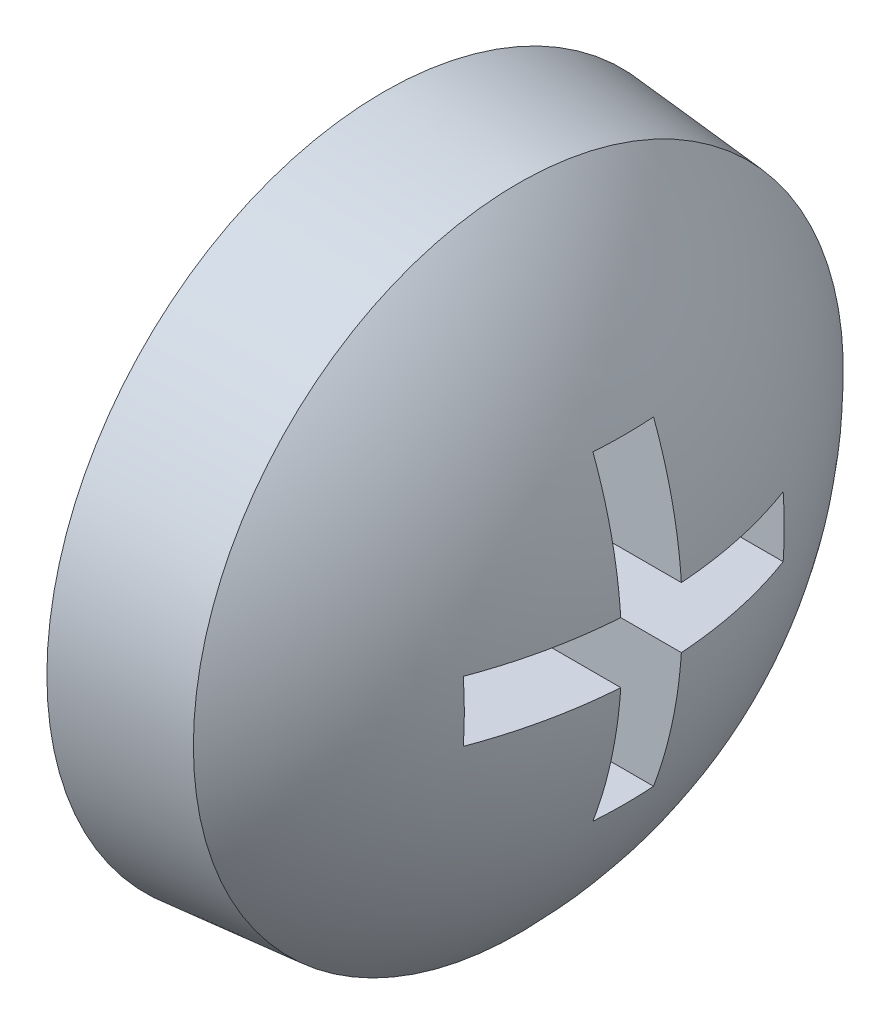
ISO-10303-21;
HEADER;
FILE_DESCRIPTION(('STEP AP214'),'2;1');
FILE_NAME('part.step','',(''),(''),'','','');
FILE_SCHEMA(('AUTOMOTIVE_DESIGN { 1 0 10303 214 1 1 1 1 }'));
ENDSEC;
DATA;
#1=APPLICATION_CONTEXT('core data for automotive mechanical design processes');
#2=APPLICATION_PROTOCOL_DEFINITION('international standard','automotive_design',2000,#1);
#3=PRODUCT_CONTEXT('',#1,'mechanical');
#4=PRODUCT('Part','Part','',(#3));
#5=PRODUCT_RELATED_PRODUCT_CATEGORY('part','',(#4));
#6=PRODUCT_DEFINITION_FORMATION('','',#4);
#7=PRODUCT_DEFINITION_CONTEXT('part definition',#1,'design');
#8=PRODUCT_DEFINITION('design','',#6,#7);
#9=PRODUCT_DEFINITION_SHAPE('','',#8);
#10=(LENGTH_UNIT() NAMED_UNIT(*) SI_UNIT(.MILLI.,.METRE.));
#11=(NAMED_UNIT(*) PLANE_ANGLE_UNIT() SI_UNIT($,.RADIAN.));
#12=(NAMED_UNIT(*) SI_UNIT($,.STERADIAN.) SOLID_ANGLE_UNIT());
#13=UNCERTAINTY_MEASURE_WITH_UNIT(LENGTH_MEASURE(1.E-05),#10,'distance_accuracy_value','');
#14=(GEOMETRIC_REPRESENTATION_CONTEXT(3) GLOBAL_UNCERTAINTY_ASSIGNED_CONTEXT((#13)) GLOBAL_UNIT_ASSIGNED_CONTEXT((#10,
#11,#12)) REPRESENTATION_CONTEXT('',''));
#15=CARTESIAN_POINT('',(0.,0.,0.));
#16=DIRECTION('',(0.,0.,1.));
#17=DIRECTION('',(1.,0.,0.));
#18=AXIS2_PLACEMENT_3D('',#15,#16,#17);
#19=CARTESIAN_POINT('',(104.166666666667,6.9,10.));
#20=DIRECTION('',(1.,0.,0.));
#21=DIRECTION('',(0.,0.,-1.));
#22=AXIS2_PLACEMENT_3D('',#19,#20,#21);
#23=PLANE('',#22);
#24=DIRECTION('',(0.,0.,1.));
#25=VECTOR('',#24,1.);
#26=CARTESIAN_POINT('',(104.166666666667,5.95,10.));
#27=LINE('',#26,#25);
#28=CARTESIAN_POINT('',(104.166666666667,5.95,9.82));
#29=VERTEX_POINT('',#28);
#30=CARTESIAN_POINT('',(104.166666666667,5.95,10.18));
#31=VERTEX_POINT('',#30);
#32=EDGE_CURVE('E293',#29,#31,#27,.T.);
#33=ORIENTED_EDGE('',*,*,#32,.F.);
#34=DIRECTION('',(0.,1.,0.));
#35=VECTOR('',#34,1.);
#36=CARTESIAN_POINT('',(104.166666666667,6.9,9.82));
#37=LINE('',#36,#35);
#38=CARTESIAN_POINT('',(104.166666666667,6.72,9.82));
#39=VERTEX_POINT('',#38);
#40=EDGE_CURVE('E298',#39,#29,#37,.F.);
#41=ORIENTED_EDGE('',*,*,#40,.F.);
#42=DIRECTION('',(0.,0.,1.));
#43=VECTOR('',#42,1.);
#44=CARTESIAN_POINT('',(104.166666666667,6.72,10.));
#45=LINE('',#44,#43);
#46=CARTESIAN_POINT('',(104.166666666667,6.72,9.05));
#47=VERTEX_POINT('',#46);
#48=EDGE_CURVE('E303',#47,#39,#45,.T.);
#49=ORIENTED_EDGE('',*,*,#48,.F.);
#50=DIRECTION('',(0.,1.,0.));
#51=VECTOR('',#50,1.);
#52=CARTESIAN_POINT('',(104.166666666667,6.9,9.05));
#53=LINE('',#52,#51);
#54=CARTESIAN_POINT('',(104.166666666667,7.08,9.05));
#55=VERTEX_POINT('',#54);
#56=EDGE_CURVE('E308',#55,#47,#53,.F.);
#57=ORIENTED_EDGE('',*,*,#56,.F.);
#58=DIRECTION('',(0.,0.,-1.));
#59=VECTOR('',#58,1.);
#60=CARTESIAN_POINT('',(104.166666666667,7.08,10.));
#61=LINE('',#60,#59);
#62=CARTESIAN_POINT('',(104.166666666667,7.08,9.82));
#63=VERTEX_POINT('',#62);
#64=EDGE_CURVE('E313',#63,#55,#61,.T.);
#65=ORIENTED_EDGE('',*,*,#64,.F.);
#66=DIRECTION('',(0.,1.,0.));
#67=VECTOR('',#66,1.);
#68=CARTESIAN_POINT('',(104.166666666667,6.9,9.82));
#69=LINE('',#68,#67);
#70=CARTESIAN_POINT('',(104.166666666667,7.85,9.82));
#71=VERTEX_POINT('',#70);
#72=EDGE_CURVE('E318',#71,#63,#69,.F.);
#73=ORIENTED_EDGE('',*,*,#72,.F.);
#74=DIRECTION('',(0.,0.,1.));
#75=VECTOR('',#74,1.);
#76=CARTESIAN_POINT('',(104.166666666667,7.85,10.));
#77=LINE('',#76,#75);
#78=CARTESIAN_POINT('',(104.166666666667,7.85,10.18));
#79=VERTEX_POINT('',#78);
#80=EDGE_CURVE('E267',#71,#79,#77,.T.);
#81=ORIENTED_EDGE('',*,*,#80,.T.);
#82=DIRECTION('',(0.,1.,0.));
#83=VECTOR('',#82,1.);
#84=CARTESIAN_POINT('',(104.166666666667,6.9,10.18));
#85=LINE('',#84,#83);
#86=CARTESIAN_POINT('',(104.166666666667,7.08,10.18));
#87=VERTEX_POINT('',#86);
#88=EDGE_CURVE('E264',#87,#79,#85,.T.);
#89=ORIENTED_EDGE('',*,*,#88,.F.);
#90=DIRECTION('',(0.,0.,-1.));
#91=VECTOR('',#90,1.);
#92=CARTESIAN_POINT('',(104.166666666667,7.08,10.));
#93=LINE('',#92,#91);
#94=CARTESIAN_POINT('',(104.166666666667,7.08,10.95));
#95=VERTEX_POINT('',#94);
#96=EDGE_CURVE('E260',#95,#87,#93,.T.);
#97=ORIENTED_EDGE('',*,*,#96,.F.);
#98=DIRECTION('',(0.,1.,0.));
#99=VECTOR('',#98,1.);
#100=CARTESIAN_POINT('',(104.166666666667,6.9,10.95));
#101=LINE('',#100,#99);
#102=CARTESIAN_POINT('',(104.166666666667,6.72,10.95));
#103=VERTEX_POINT('',#102);
#104=EDGE_CURVE('E231',#95,#103,#101,.F.);
#105=ORIENTED_EDGE('',*,*,#104,.T.);
#106=DIRECTION('',(0.,0.,1.));
#107=VECTOR('',#106,1.);
#108=CARTESIAN_POINT('',(104.166666666667,6.72,10.));
#109=LINE('',#108,#107);
#110=CARTESIAN_POINT('',(104.166666666667,6.72,10.18));
#111=VERTEX_POINT('',#110);
#112=EDGE_CURVE('E278',#111,#103,#109,.T.);
#113=ORIENTED_EDGE('',*,*,#112,.F.);
#114=DIRECTION('',(0.,1.,0.));
#115=VECTOR('',#114,1.);
#116=CARTESIAN_POINT('',(104.166666666667,6.9,10.18));
#117=LINE('',#116,#115);
#118=EDGE_CURVE('E288',#31,#111,#117,.T.);
#119=ORIENTED_EDGE('',*,*,#118,.F.);
#120=EDGE_LOOP('',(#33,#41,#49,#57,#65,#73,#81,#89,#97,#105,#113,#119));
#121=FACE_BOUND('',#120,.T.);
#122=ADVANCED_FACE('F17',(#121),#23,.T.);
#123=CARTESIAN_POINT('',(104.766666666667,7.08,10.));
#124=DIRECTION('',(0.,-1.,0.));
#125=DIRECTION('',(0.,0.,-1.));
#126=AXIS2_PLACEMENT_3D('',#123,#124,#125);
#127=PLANE('',#126);
#128=DIRECTION('',(1.,0.,0.));
#129=VECTOR('',#128,1.);
#130=CARTESIAN_POINT('',(104.766666666667,7.08,10.95));
#131=LINE('',#130,#129);
#132=CARTESIAN_POINT('',(105.189571189858,7.08,10.9499999999999));
#133=VERTEX_POINT('',#132);
#134=EDGE_CURVE('E89',#133,#95,#131,.F.);
#135=ORIENTED_EDGE('',*,*,#134,.T.);
#136=ORIENTED_EDGE('',*,*,#96,.T.);
#137=DIRECTION('',(-1.,0.,0.));
#138=VECTOR('',#137,1.);
#139=CARTESIAN_POINT('',(104.766666666667,7.08,10.18));
#140=LINE('',#139,#138);
#141=CARTESIAN_POINT('',(105.354764236461,7.07999999999998,10.18));
#142=VERTEX_POINT('',#141);
#143=EDGE_CURVE('E224',#142,#87,#140,.T.);
#144=ORIENTED_EDGE('',*,*,#143,.F.);
#145=CARTESIAN_POINT('',(105.189571189858,7.08,10.9499999999998));
#146=CARTESIAN_POINT('',(105.201116204051,7.08,10.9189995540504));
#147=CARTESIAN_POINT('',(105.212095586435,7.08,10.8877884938066));
#148=CARTESIAN_POINT('',(105.232868784973,7.08,10.8251104536467));
#149=CARTESIAN_POINT('',(105.242667091984,7.08,10.7936449620739));
#150=CARTESIAN_POINT('',(105.261090632624,7.08,10.7304618501355));
#151=CARTESIAN_POINT('',(105.269718872253,7.08,10.6987451062671));
#152=CARTESIAN_POINT('',(105.28581062142,7.08,10.6350619663154));
#153=CARTESIAN_POINT('',(105.293275650242,7.08,10.6030959541241));
#154=CARTESIAN_POINT('',(105.307044828628,7.08,10.5389148788567));
#155=CARTESIAN_POINT('',(105.313348978193,7.08,10.5066998157807));
#156=CARTESIAN_POINT('',(105.324795725558,7.08,10.4420201537523));
#157=CARTESIAN_POINT('',(105.329936780304,7.08,10.4095552817085));
#158=CARTESIAN_POINT('',(105.339051828977,7.08,10.3443751591892));
#159=CARTESIAN_POINT('',(105.343022721906,7.08,10.3116594750372));
#160=CARTESIAN_POINT('',(105.349787708815,7.08,10.2459761632456));
#161=CARTESIAN_POINT('',(105.352577096634,7.08,10.2130080508537));
#162=CARTESIAN_POINT('',(105.35476423646,7.08,10.18));
#163=B_SPLINE_CURVE_WITH_KNOTS('',3,(#145,#146,#147,#148,#149,#150,#151,#152,#153,#154,#155,
#156,#157,#158,#159,#160,#161,#162),.UNSPECIFIED.,.F.,.F.,(4,2,2,2,2,2,2,2,4),(0.,
0.0992357442434011,0.198081387639235,0.296668072480437,0.395124892694024,0.493581712907605,
0.592168397748812,0.691014041144642,0.790249785388046),.UNSPECIFIED.);
#164=EDGE_CURVE('E20',#133,#142,#163,.T.);
#165=ORIENTED_EDGE('',*,*,#164,.F.);
#166=EDGE_LOOP('',(#135,#136,#144,#165));
#167=FACE_BOUND('',#166,.T.);
#168=ADVANCED_FACE('F221',(#167),#127,.T.);
#169=CARTESIAN_POINT('',(104.766666666667,6.9,10.18));
#170=DIRECTION('',(0.,0.,-1.));
#171=DIRECTION('',(-1.,0.,0.));
#172=AXIS2_PLACEMENT_3D('',#169,#170,#171);
#173=PLANE('',#172);
#174=ORIENTED_EDGE('',*,*,#88,.T.);
#175=DIRECTION('',(1.,0.,0.));
#176=VECTOR('',#175,1.);
#177=CARTESIAN_POINT('',(104.766666666667,7.85,10.18));
#178=LINE('',#177,#176);
#179=CARTESIAN_POINT('',(105.189571189858,7.85,10.18));
#180=VERTEX_POINT('',#179);
#181=EDGE_CURVE('E324',#79,#180,#178,.T.);
#182=ORIENTED_EDGE('',*,*,#181,.T.);
#183=CARTESIAN_POINT('',(105.35476423646,7.07999999999996,10.18));
#184=CARTESIAN_POINT('',(105.349110057772,7.16559008255577,10.18));
#185=CARTESIAN_POINT('',(105.339378570371,7.25090347737763,10.18));
#186=CARTESIAN_POINT('',(105.312011452855,7.4196590615976,10.18));
#187=CARTESIAN_POINT('',(105.294429898816,7.50311001948186,10.18));
#188=CARTESIAN_POINT('',(105.249700769254,7.67504249159032,10.18));
#189=CARTESIAN_POINT('',(105.221864706158,7.7633453110033,10.18));
#190=CARTESIAN_POINT('',(105.189571189858,7.84999999999982,10.18));
#191=B_SPLINE_CURVE_WITH_KNOTS('',3,(#183,#184,#185,#186,#187,#188,#189,#190),.UNSPECIFIED.,.F.,
.F.,(4,2,2,4),(0.,0.257221658829311,0.512698117737293,0.789983486231456),.UNSPECIFIED.);
#192=EDGE_CURVE('E213',#142,#180,#191,.T.);
#193=ORIENTED_EDGE('',*,*,#192,.F.);
#194=ORIENTED_EDGE('',*,*,#143,.T.);
#195=EDGE_LOOP('',(#174,#182,#193,#194));
#196=FACE_BOUND('',#195,.T.);
#197=ADVANCED_FACE('F204',(#196),#173,.T.);
#198=CARTESIAN_POINT('',(104.766666666667,7.85,10.));
#199=DIRECTION('',(0.,1.,0.));
#200=DIRECTION('',(0.,0.,1.));
#201=AXIS2_PLACEMENT_3D('',#198,#199,#200);
#202=PLANE('',#201);
#203=ORIENTED_EDGE('',*,*,#181,.F.);
#204=ORIENTED_EDGE('',*,*,#80,.F.);
#205=DIRECTION('',(1.,0.,0.));
#206=VECTOR('',#205,1.);
#207=CARTESIAN_POINT('',(104.766666666667,7.85,9.82));
#208=LINE('',#207,#206);
#209=CARTESIAN_POINT('',(105.189571189858,7.84999999999991,9.82));
#210=VERTEX_POINT('',#209);
#211=EDGE_CURVE('E320',#210,#71,#208,.F.);
#212=ORIENTED_EDGE('',*,*,#211,.F.);
#213=CARTESIAN_POINT('',(105.189571189857,7.85,10.18));
#214=CARTESIAN_POINT('',(105.193799585556,7.85000000000002,10.12));
#215=CARTESIAN_POINT('',(105.195913783405,7.85000000000002,10.06));
#216=CARTESIAN_POINT('',(105.195913783405,7.84999999999998,9.93999999999997));
#217=CARTESIAN_POINT('',(105.193799585556,7.84999999999994,9.87999999999998));
#218=CARTESIAN_POINT('',(105.189571189857,7.84999999999989,9.81999999999998));
#219=B_SPLINE_CURVE_WITH_KNOTS('',3,(#213,#214,#215,#216,#217,#218),.UNSPECIFIED.,.F.,.F.,(4,2,
4),(0.,0.180111711148678,0.360223422297357),.UNSPECIFIED.);
#220=EDGE_CURVE('E207',#180,#210,#219,.T.);
#221=ORIENTED_EDGE('',*,*,#220,.F.);
#222=EDGE_LOOP('',(#203,#204,#212,#221));
#223=FACE_BOUND('',#222,.T.);
#224=ADVANCED_FACE('F199',(#223),#202,.F.);
#225=CARTESIAN_POINT('',(104.766666666667,6.9,9.82));
#226=DIRECTION('',(0.,0.,1.));
#227=DIRECTION('',(1.,0.,0.));
#228=AXIS2_PLACEMENT_3D('',#225,#226,#227);
#229=PLANE('',#228);
#230=ORIENTED_EDGE('',*,*,#72,.T.);
#231=DIRECTION('',(1.,0.,0.));
#232=VECTOR('',#231,1.);
#233=CARTESIAN_POINT('',(104.766666666667,7.08,9.82));
#234=LINE('',#233,#232);
#235=CARTESIAN_POINT('',(105.354764236461,7.08,9.82000000000002));
#236=VERTEX_POINT('',#235);
#237=EDGE_CURVE('E315',#236,#63,#234,.F.);
#238=ORIENTED_EDGE('',*,*,#237,.F.);
#239=CARTESIAN_POINT('',(105.189571189858,7.84999999999982,9.82));
#240=CARTESIAN_POINT('',(105.201116204051,7.8189995540504,9.82));
#241=CARTESIAN_POINT('',(105.212095586435,7.78778849380655,9.82));
#242=CARTESIAN_POINT('',(105.232868784973,7.72511045364668,9.82));
#243=CARTESIAN_POINT('',(105.242667091984,7.69364496207389,9.82));
#244=CARTESIAN_POINT('',(105.261090632624,7.63046185013545,9.82));
#245=CARTESIAN_POINT('',(105.269718872253,7.5987451062671,9.82));
#246=CARTESIAN_POINT('',(105.28581062142,7.53506196631538,9.82));
#247=CARTESIAN_POINT('',(105.293275650242,7.50309595412407,9.82));
#248=CARTESIAN_POINT('',(105.307044828628,7.43891487885672,9.82));
#249=CARTESIAN_POINT('',(105.313348978193,7.40669981578069,9.82));
#250=CARTESIAN_POINT('',(105.324795725558,7.3420201537523,9.82));
#251=CARTESIAN_POINT('',(105.329936780304,7.30955528170849,9.82));
#252=CARTESIAN_POINT('',(105.339051828977,7.24437515918925,9.82));
#253=CARTESIAN_POINT('',(105.343022721906,7.21165947503717,9.82));
#254=CARTESIAN_POINT('',(105.349787708815,7.14597616324556,9.82));
#255=CARTESIAN_POINT('',(105.352577096634,7.11300805085374,9.82));
#256=CARTESIAN_POINT('',(105.35476423646,7.07999999999997,9.82));
#257=B_SPLINE_CURVE_WITH_KNOTS('',3,(#239,#240,#241,#242,#243,#244,#245,#246,#247,#248,#249,
#250,#251,#252,#253,#254,#255,#256),.UNSPECIFIED.,.F.,.F.,(4,2,2,2,2,2,2,2,4),(0.,
0.0992357442434019,0.198081387639233,0.296668072480435,0.39512489269402,0.493581712907601,
0.592168397748805,0.691014041144637,0.790249785388038),.UNSPECIFIED.);
#258=EDGE_CURVE('E184',#210,#236,#257,.T.);
#259=ORIENTED_EDGE('',*,*,#258,.F.);
#260=ORIENTED_EDGE('',*,*,#211,.T.);
#261=EDGE_LOOP('',(#230,#238,#259,#260));
#262=FACE_BOUND('',#261,.T.);
#263=ADVANCED_FACE('F194',(#262),#229,.T.);
#264=CARTESIAN_POINT('',(104.766666666667,7.08,10.));
#265=DIRECTION('',(0.,-1.,0.));
#266=DIRECTION('',(0.,0.,-1.));
#267=AXIS2_PLACEMENT_3D('',#264,#265,#266);
#268=PLANE('',#267);
#269=DIRECTION('',(1.,0.,0.));
#270=VECTOR('',#269,1.);
#271=CARTESIAN_POINT('',(104.766666666667,7.08,9.05));
#272=LINE('',#271,#270);
#273=CARTESIAN_POINT('',(105.189571189858,7.08,9.05));
#274=VERTEX_POINT('',#273);
#275=EDGE_CURVE('E310',#274,#55,#272,.F.);
#276=ORIENTED_EDGE('',*,*,#275,.F.);
#277=CARTESIAN_POINT('',(105.35476423646,7.08,9.82000000000004));
#278=CARTESIAN_POINT('',(105.349110057772,7.08,9.73440991744423));
#279=CARTESIAN_POINT('',(105.339378570371,7.08,9.64909652262237));
#280=CARTESIAN_POINT('',(105.312011452855,7.08,9.4803409384024));
#281=CARTESIAN_POINT('',(105.294429898816,7.08,9.39688998051814));
#282=CARTESIAN_POINT('',(105.249700769254,7.08,9.22495750840968));
#283=CARTESIAN_POINT('',(105.221864706158,7.08,9.1366546889967));
#284=CARTESIAN_POINT('',(105.189571189858,7.08,9.05000000000018));
#285=B_SPLINE_CURVE_WITH_KNOTS('',3,(#277,#278,#279,#280,#281,#282,#283,#284),.UNSPECIFIED.,.F.,
.F.,(4,2,2,4),(0.,0.25722165882931,0.512698117737293,0.789983486231462),.UNSPECIFIED.);
#286=EDGE_CURVE('E176',#236,#274,#285,.T.);
#287=ORIENTED_EDGE('',*,*,#286,.F.);
#288=ORIENTED_EDGE('',*,*,#237,.T.);
#289=ORIENTED_EDGE('',*,*,#64,.T.);
#290=EDGE_LOOP('',(#276,#287,#288,#289));
#291=FACE_BOUND('',#290,.T.);
#292=ADVANCED_FACE('F191',(#291),#268,.T.);
#293=CARTESIAN_POINT('',(104.766666666667,6.9,9.05));
#294=DIRECTION('',(0.,0.,1.));
#295=DIRECTION('',(1.,0.,0.));
#296=AXIS2_PLACEMENT_3D('',#293,#294,#295);
#297=PLANE('',#296);
#298=DIRECTION('',(1.,0.,0.));
#299=VECTOR('',#298,1.);
#300=CARTESIAN_POINT('',(104.766666666667,6.72,9.05));
#301=LINE('',#300,#299);
#302=CARTESIAN_POINT('',(105.189571189858,6.72,9.05000000000009));
#303=VERTEX_POINT('',#302);
#304=EDGE_CURVE('E305',#303,#47,#301,.F.);
#305=ORIENTED_EDGE('',*,*,#304,.F.);
#306=CARTESIAN_POINT('',(105.189571189858,6.72,9.05));
#307=CARTESIAN_POINT('',(105.195913783405,6.80988825418764,9.05));
#308=CARTESIAN_POINT('',(105.195913783405,6.9,9.05));
#309=B_SPLINE_CURVE_WITH_KNOTS('',2,(#306,#307,#308),.UNSPECIFIED.,.F.,.F.,(3,3),(0.,1.),.UNSPECIFIED.);
#310=CARTESIAN_POINT('',(105.195913783405,6.9,9.05));
#311=VERTEX_POINT('',#310);
#312=EDGE_CURVE('E175',#311,#303,#309,.F.);
#313=ORIENTED_EDGE('',*,*,#312,.F.);
#314=CARTESIAN_POINT('',(105.195913783405,6.9,9.05));
#315=CARTESIAN_POINT('',(105.195913783405,6.99011174581236,9.05));
#316=CARTESIAN_POINT('',(105.189571189858,7.08,9.05));
#317=B_SPLINE_CURVE_WITH_KNOTS('',2,(#314,#315,#316),.UNSPECIFIED.,.F.,.F.,(3,3),(0.,1.),.UNSPECIFIED.);
#318=EDGE_CURVE('E183',#274,#311,#317,.F.);
#319=ORIENTED_EDGE('',*,*,#318,.F.);
#320=ORIENTED_EDGE('',*,*,#275,.T.);
#321=ORIENTED_EDGE('',*,*,#56,.T.);
#322=EDGE_LOOP('',(#305,#313,#319,#320,#321));
#323=FACE_BOUND('',#322,.T.);
#324=ADVANCED_FACE('F164',(#323),#297,.T.);
#325=CARTESIAN_POINT('',(104.766666666667,6.72,10.));
#326=DIRECTION('',(0.,1.,0.));
#327=DIRECTION('',(0.,0.,1.));
#328=AXIS2_PLACEMENT_3D('',#325,#326,#327);
#329=PLANE('',#328);
#330=ORIENTED_EDGE('',*,*,#304,.T.);
#331=ORIENTED_EDGE('',*,*,#48,.T.);
#332=DIRECTION('',(1.,0.,0.));
#333=VECTOR('',#332,1.);
#334=CARTESIAN_POINT('',(104.766666666667,6.72,9.82));
#335=LINE('',#334,#333);
#336=CARTESIAN_POINT('',(105.354764236461,6.72000000000002,9.82));
#337=VERTEX_POINT('',#336);
#338=EDGE_CURVE('E300',#337,#39,#335,.F.);
#339=ORIENTED_EDGE('',*,*,#338,.F.);
#340=CARTESIAN_POINT('',(105.189571189858,6.72,9.05000000000018));
#341=CARTESIAN_POINT('',(105.201116204051,6.72,9.08100044594959));
#342=CARTESIAN_POINT('',(105.212095586435,6.72,9.11221150619344));
#343=CARTESIAN_POINT('',(105.232868784973,6.72,9.17488954635332));
#344=CARTESIAN_POINT('',(105.242667091984,6.72,9.20635503792611));
#345=CARTESIAN_POINT('',(105.261090632624,6.72,9.26953814986455));
#346=CARTESIAN_POINT('',(105.269718872253,6.72,9.3012548937329));
#347=CARTESIAN_POINT('',(105.28581062142,6.72,9.36493803368462));
#348=CARTESIAN_POINT('',(105.293275650242,6.72,9.39690404587594));
#349=CARTESIAN_POINT('',(105.307044828628,6.72,9.46108512114328));
#350=CARTESIAN_POINT('',(105.313348978193,6.72,9.49330018421931));
#351=CARTESIAN_POINT('',(105.324795725559,6.72,9.5579798462477));
#352=CARTESIAN_POINT('',(105.329936780304,6.72,9.59044471829152));
#353=CARTESIAN_POINT('',(105.339051828977,6.72,9.65562484081076));
#354=CARTESIAN_POINT('',(105.343022721906,6.72,9.68834052496284));
#355=CARTESIAN_POINT('',(105.349787708815,6.72,9.75402383675445));
#356=CARTESIAN_POINT('',(105.352577096634,6.72,9.78699194914627));
#357=CARTESIAN_POINT('',(105.35476423646,6.72,9.82000000000004));
#358=B_SPLINE_CURVE_WITH_KNOTS('',3,(#340,#341,#342,#343,#344,#345,#346,#347,#348,#349,#350,
#351,#352,#353,#354,#355,#356,#357),.UNSPECIFIED.,.F.,.F.,(4,2,2,2,2,2,2,2,4),(0.,
0.0992357442434011,0.198081387639235,0.296668072480437,0.395124892694024,0.493581712907606,
0.592168397748816,0.691014041144647,0.790249785388048),.UNSPECIFIED.);
#359=EDGE_CURVE('E168',#303,#337,#358,.T.);
#360=ORIENTED_EDGE('',*,*,#359,.F.);
#361=EDGE_LOOP('',(#330,#331,#339,#360));
#362=FACE_BOUND('',#361,.T.);
#363=ADVANCED_FACE('F159',(#362),#329,.T.);
#364=CARTESIAN_POINT('',(104.766666666667,6.9,9.82));
#365=DIRECTION('',(0.,0.,1.));
#366=DIRECTION('',(1.,0.,0.));
#367=AXIS2_PLACEMENT_3D('',#364,#365,#366);
#368=PLANE('',#367);
#369=ORIENTED_EDGE('',*,*,#40,.T.);
#370=DIRECTION('',(1.,0.,0.));
#371=VECTOR('',#370,1.);
#372=CARTESIAN_POINT('',(104.766666666667,5.95,9.82));
#373=LINE('',#372,#371);
#374=CARTESIAN_POINT('',(105.189571189858,5.95,9.82000000000002));
#375=VERTEX_POINT('',#374);
#376=EDGE_CURVE('E295',#375,#29,#373,.F.);
#377=ORIENTED_EDGE('',*,*,#376,.F.);
#378=CARTESIAN_POINT('',(105.35476423646,6.72000000000004,9.82));
#379=CARTESIAN_POINT('',(105.349110057772,6.63440991744423,9.82));
#380=CARTESIAN_POINT('',(105.339378570371,6.54909652262237,9.82));
#381=CARTESIAN_POINT('',(105.312011452855,6.3803409384024,9.82));
#382=CARTESIAN_POINT('',(105.294429898816,6.29688998051814,9.82));
#383=CARTESIAN_POINT('',(105.249700769254,6.12495750840968,9.82));
#384=CARTESIAN_POINT('',(105.221864706158,6.0366546889967,9.82));
#385=CARTESIAN_POINT('',(105.189571189858,5.95000000000018,9.82));
#386=B_SPLINE_CURVE_WITH_KNOTS('',3,(#378,#379,#380,#381,#382,#383,#384,#385),.UNSPECIFIED.,.F.,
.F.,(4,2,2,4),(0.,0.25722165882931,0.512698117737293,0.789983486231459),.UNSPECIFIED.);
#387=EDGE_CURVE('E144',#337,#375,#386,.T.);
#388=ORIENTED_EDGE('',*,*,#387,.F.);
#389=ORIENTED_EDGE('',*,*,#338,.T.);
#390=EDGE_LOOP('',(#369,#377,#388,#389));
#391=FACE_BOUND('',#390,.T.);
#392=ADVANCED_FACE('F154',(#391),#368,.T.);
#393=CARTESIAN_POINT('',(104.766666666667,5.95,10.));
#394=DIRECTION('',(0.,1.,0.));
#395=DIRECTION('',(0.,0.,1.));
#396=AXIS2_PLACEMENT_3D('',#393,#394,#395);
#397=PLANE('',#396);
#398=ORIENTED_EDGE('',*,*,#32,.T.);
#399=DIRECTION('',(-1.,0.,0.));
#400=VECTOR('',#399,1.);
#401=CARTESIAN_POINT('',(104.766666666667,5.95,10.18));
#402=LINE('',#401,#400);
#403=CARTESIAN_POINT('',(105.189571189858,5.95000000000009,10.18));
#404=VERTEX_POINT('',#403);
#405=EDGE_CURVE('E290',#404,#31,#402,.T.);
#406=ORIENTED_EDGE('',*,*,#405,.F.);
#407=CARTESIAN_POINT('',(105.189571189857,5.95,9.82000000000004));
#408=CARTESIAN_POINT('',(105.193799585556,5.94999999999999,9.88000000000004));
#409=CARTESIAN_POINT('',(105.195913783405,5.94999999999999,9.94000000000003));
#410=CARTESIAN_POINT('',(105.195913783405,5.95000000000001,10.06));
#411=CARTESIAN_POINT('',(105.193799585556,5.95000000000003,10.12));
#412=CARTESIAN_POINT('',(105.189571189857,5.95000000000006,10.18));
#413=B_SPLINE_CURVE_WITH_KNOTS('',3,(#407,#408,#409,#410,#411,#412),.UNSPECIFIED.,.F.,.F.,(4,2,
4),(0.,0.18011171114868,0.360223422297359),.UNSPECIFIED.);
#414=EDGE_CURVE('E137',#375,#404,#413,.T.);
#415=ORIENTED_EDGE('',*,*,#414,.F.);
#416=ORIENTED_EDGE('',*,*,#376,.T.);
#417=EDGE_LOOP('',(#398,#406,#415,#416));
#418=FACE_BOUND('',#417,.T.);
#419=ADVANCED_FACE('F151',(#418),#397,.T.);
#420=CARTESIAN_POINT('',(104.766666666667,6.9,10.18));
#421=DIRECTION('',(0.,0.,-1.));
#422=DIRECTION('',(-1.,0.,0.));
#423=AXIS2_PLACEMENT_3D('',#420,#421,#422);
#424=PLANE('',#423);
#425=ORIENTED_EDGE('',*,*,#118,.T.);
#426=DIRECTION('',(1.,0.,0.));
#427=VECTOR('',#426,1.);
#428=CARTESIAN_POINT('',(104.766666666667,6.72,10.18));
#429=LINE('',#428,#427);
#430=CARTESIAN_POINT('',(105.354764236461,6.72,10.18));
#431=VERTEX_POINT('',#430);
#432=EDGE_CURVE('E280',#431,#111,#429,.F.);
#433=ORIENTED_EDGE('',*,*,#432,.F.);
#434=CARTESIAN_POINT('',(105.189571189858,5.95000000000018,10.18));
#435=CARTESIAN_POINT('',(105.201116204051,5.9810004459496,10.18));
#436=CARTESIAN_POINT('',(105.212095586435,6.01221150619345,10.18));
#437=CARTESIAN_POINT('',(105.232868784973,6.07488954635332,10.18));
#438=CARTESIAN_POINT('',(105.242667091984,6.10635503792611,10.18));
#439=CARTESIAN_POINT('',(105.261090632624,6.16953814986455,10.18));
#440=CARTESIAN_POINT('',(105.269718872253,6.2012548937329,10.18));
#441=CARTESIAN_POINT('',(105.28581062142,6.26493803368462,10.18));
#442=CARTESIAN_POINT('',(105.293275650242,6.29690404587594,10.18));
#443=CARTESIAN_POINT('',(105.307044828628,6.36108512114328,10.18));
#444=CARTESIAN_POINT('',(105.313348978193,6.39330018421931,10.18));
#445=CARTESIAN_POINT('',(105.324795725558,6.4579798462477,10.18));
#446=CARTESIAN_POINT('',(105.329936780304,6.49044471829152,10.18));
#447=CARTESIAN_POINT('',(105.339051828977,6.55562484081075,10.18));
#448=CARTESIAN_POINT('',(105.343022721906,6.58834052496284,10.18));
#449=CARTESIAN_POINT('',(105.349787708815,6.65402383675445,10.18));
#450=CARTESIAN_POINT('',(105.352577096634,6.68699194914626,10.18));
#451=CARTESIAN_POINT('',(105.35476423646,6.72000000000004,10.18));
#452=B_SPLINE_CURVE_WITH_KNOTS('',3,(#434,#435,#436,#437,#438,#439,#440,#441,#442,#443,#444,
#445,#446,#447,#448,#449,#450,#451),.UNSPECIFIED.,.F.,.F.,(4,2,2,2,2,2,2,2,4),(0.,
0.0992357442434011,0.198081387639235,0.296668072480436,0.395124892694023,0.493581712907604,
0.592168397748812,0.691014041144643,0.790249785388045),.UNSPECIFIED.);
#453=EDGE_CURVE('E100',#404,#431,#452,.T.);
#454=ORIENTED_EDGE('',*,*,#453,.F.);
#455=ORIENTED_EDGE('',*,*,#405,.T.);
#456=EDGE_LOOP('',(#425,#433,#454,#455));
#457=FACE_BOUND('',#456,.T.);
#458=ADVANCED_FACE('F123',(#457),#424,.T.);
#459=CARTESIAN_POINT('',(104.766666666667,6.72,10.));
#460=DIRECTION('',(0.,1.,0.));
#461=DIRECTION('',(0.,0.,1.));
#462=AXIS2_PLACEMENT_3D('',#459,#460,#461);
#463=PLANE('',#462);
#464=DIRECTION('',(1.,0.,0.));
#465=VECTOR('',#464,1.);
#466=CARTESIAN_POINT('',(104.766666666667,6.72,10.95));
#467=LINE('',#466,#465);
#468=CARTESIAN_POINT('',(105.189571189858,6.72,10.95));
#469=VERTEX_POINT('',#468);
#470=EDGE_CURVE('E40',#103,#469,#467,.T.);
#471=ORIENTED_EDGE('',*,*,#470,.T.);
#472=CARTESIAN_POINT('',(105.35476423646,6.72,10.18));
#473=CARTESIAN_POINT('',(105.349110057772,6.72,10.2655900825558));
#474=CARTESIAN_POINT('',(105.339378570371,6.72,10.3509034773776));
#475=CARTESIAN_POINT('',(105.312011452855,6.72,10.5196590615976));
#476=CARTESIAN_POINT('',(105.294429898816,6.72,10.6031100194819));
#477=CARTESIAN_POINT('',(105.249700769254,6.72,10.7750424915903));
#478=CARTESIAN_POINT('',(105.221864706158,6.72,10.8633453110033));
#479=CARTESIAN_POINT('',(105.189571189858,6.72,10.9499999999998));
#480=B_SPLINE_CURVE_WITH_KNOTS('',3,(#472,#473,#474,#475,#476,#477,#478,#479),.UNSPECIFIED.,.F.,
.F.,(4,2,2,4),(0.,0.257221658829312,0.512698117737295,0.789983486231462),.UNSPECIFIED.);
#481=EDGE_CURVE('E96',#431,#469,#480,.T.);
#482=ORIENTED_EDGE('',*,*,#481,.F.);
#483=ORIENTED_EDGE('',*,*,#432,.T.);
#484=ORIENTED_EDGE('',*,*,#112,.T.);
#485=EDGE_LOOP('',(#471,#482,#483,#484));
#486=FACE_BOUND('',#485,.T.);
#487=ADVANCED_FACE('F115',(#486),#463,.T.);
#488=CARTESIAN_POINT('',(104.766666666667,6.9,10.95));
#489=DIRECTION('',(0.,0.,1.));
#490=DIRECTION('',(1.,0.,0.));
#491=AXIS2_PLACEMENT_3D('',#488,#489,#490);
#492=PLANE('',#491);
#493=ORIENTED_EDGE('',*,*,#470,.F.);
#494=ORIENTED_EDGE('',*,*,#104,.F.);
#495=ORIENTED_EDGE('',*,*,#134,.F.);
#496=CARTESIAN_POINT('',(105.195913783405,6.9,10.95));
#497=CARTESIAN_POINT('',(105.195913783405,6.99011174581236,10.95));
#498=CARTESIAN_POINT('',(105.189571189858,7.08,10.95));
#499=B_SPLINE_CURVE_WITH_KNOTS('',2,(#496,#497,#498),.UNSPECIFIED.,.F.,.F.,(3,3),(0.,1.),.UNSPECIFIED.);
#500=CARTESIAN_POINT('',(105.195913783405,6.9,10.95));
#501=VERTEX_POINT('',#500);
#502=EDGE_CURVE('E82',#501,#133,#499,.T.);
#503=ORIENTED_EDGE('',*,*,#502,.F.);
#504=CARTESIAN_POINT('',(105.189571189858,6.72,10.95));
#505=CARTESIAN_POINT('',(105.195913783405,6.80988825418764,10.95));
#506=CARTESIAN_POINT('',(105.195913783405,6.9,10.95));
#507=B_SPLINE_CURVE_WITH_KNOTS('',2,(#504,#505,#506),.UNSPECIFIED.,.F.,.F.,(3,3),(0.,1.),.UNSPECIFIED.);
#508=EDGE_CURVE('E85',#469,#501,#507,.T.);
#509=ORIENTED_EDGE('',*,*,#508,.F.);
#510=EDGE_LOOP('',(#493,#494,#495,#503,#509));
#511=FACE_BOUND('',#510,.T.);
#512=ADVANCED_FACE('F84',(#511),#492,.F.);
#513=CARTESIAN_POINT('',(102.63858228722,6.9,10.));
#514=DIRECTION('',(1.,0.,0.));
#515=DIRECTION('',(0.,1.,0.));
#516=AXIS2_PLACEMENT_3D('',#513,#514,#515);
#517=SPHERICAL_SURFACE('',#516,2.72808437944638);
#518=CARTESIAN_POINT('',(104.566666666642,6.9,10.));
#519=DIRECTION('',(-1.,0.,0.));
#520=DIRECTION('',(0.,0.,1.));
#521=AXIS2_PLACEMENT_3D('',#518,#519,#520);
#522=CIRCLE('',#521,1.93000906918229);
#523=CARTESIAN_POINT('',(104.566666666642,6.89999999999993,11.9300090691823));
#524=VERTEX_POINT('',#523);
#525=EDGE_CURVE('E31',#524,#524,#522,.T.);
#526=ORIENTED_EDGE('',*,*,#525,.F.);
#527=EDGE_LOOP('',(#526));
#528=FACE_BOUND('',#527,.T.);
#529=ORIENTED_EDGE('',*,*,#481,.T.);
#530=ORIENTED_EDGE('',*,*,#508,.T.);
#531=ORIENTED_EDGE('',*,*,#502,.T.);
#532=ORIENTED_EDGE('',*,*,#164,.T.);
#533=ORIENTED_EDGE('',*,*,#192,.T.);
#534=ORIENTED_EDGE('',*,*,#220,.T.);
#535=ORIENTED_EDGE('',*,*,#258,.T.);
#536=ORIENTED_EDGE('',*,*,#286,.T.);
#537=ORIENTED_EDGE('',*,*,#318,.T.);
#538=ORIENTED_EDGE('',*,*,#312,.T.);
#539=ORIENTED_EDGE('',*,*,#359,.T.);
#540=ORIENTED_EDGE('',*,*,#387,.T.);
#541=ORIENTED_EDGE('',*,*,#414,.T.);
#542=ORIENTED_EDGE('',*,*,#453,.T.);
#543=EDGE_LOOP('',(#529,#530,#531,#532,#533,#534,#535,#536,#537,#538,#539,#540,#541,#542));
#544=FACE_BOUND('',#543,.T.);
#545=ADVANCED_FACE('F94',(#528,#544),#517,.T.);
#546=CARTESIAN_POINT('',(103.766666666672,6.9,10.));
#547=DIRECTION('',(-1.,0.,0.));
#548=DIRECTION('',(0.,0.,1.));
#549=AXIS2_PLACEMENT_3D('',#546,#547,#548);
#550=CONICAL_SURFACE('',#549,2.00000000000045,0.0872664625936403);
#551=CARTESIAN_POINT('',(103.766666666672,6.9,10.));
#552=DIRECTION('',(-1.,0.,0.));
#553=DIRECTION('',(0.,0.,1.));
#554=AXIS2_PLACEMENT_3D('',#551,#552,#553);
#555=CIRCLE('',#554,2.00000000000045);
#556=CARTESIAN_POINT('',(103.766666666672,6.9,12.0000000000005));
#557=VERTEX_POINT('',#556);
#558=EDGE_CURVE('E11',#557,#557,#555,.T.);
#559=ORIENTED_EDGE('',*,*,#558,.F.);
#560=EDGE_LOOP('',(#559));
#561=FACE_BOUND('',#560,.T.);
#562=ORIENTED_EDGE('',*,*,#525,.T.);
#563=EDGE_LOOP('',(#562));
#564=FACE_BOUND('',#563,.T.);
#565=ADVANCED_FACE('F402',(#561,#564),#550,.T.);
#566=CARTESIAN_POINT('',(103.766666666667,6.9,11.));
#567=DIRECTION('',(-1.,0.,0.));
#568=DIRECTION('',(0.,0.,1.));
#569=AXIS2_PLACEMENT_3D('',#566,#567,#568);
#570=PLANE('',#569);
#571=ORIENTED_EDGE('',*,*,#558,.T.);
#572=EDGE_LOOP('',(#571));
#573=FACE_BOUND('',#572,.T.);
#574=ADVANCED_FACE('F400',(#573),#570,.T.);
#575=CLOSED_SHELL('',(#122,#168,#197,#224,#263,#292,#324,#363,#392,#419,#458,#487,#512,#545,
#565,#574));
#576=MANIFOLD_SOLID_BREP('B1',#575);
#577=ADVANCED_BREP_SHAPE_REPRESENTATION('',(#18,#576),#14);
#578=SHAPE_DEFINITION_REPRESENTATION(#9,#577);
ENDSEC;
END-ISO-10303-21;
